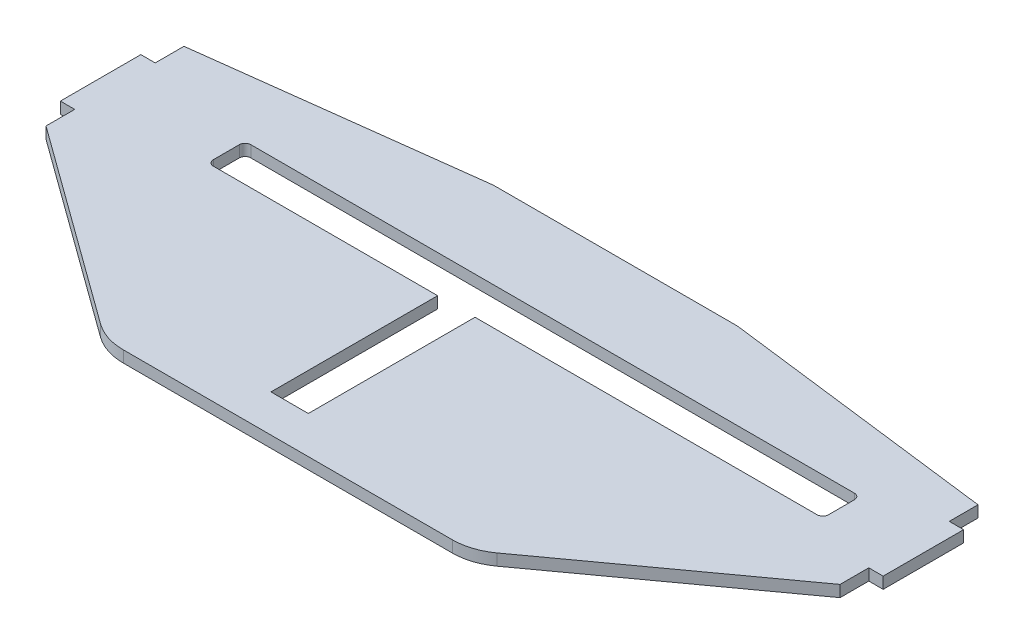
ISO-10303-21;
HEADER;
FILE_DESCRIPTION(('STEP AP214'),'2;1');
FILE_NAME('part.step','',(''),(''),'','','');
FILE_SCHEMA(('AUTOMOTIVE_DESIGN { 1 0 10303 214 1 1 1 1 }'));
ENDSEC;
DATA;
#1=APPLICATION_CONTEXT('core data for automotive mechanical design processes');
#2=APPLICATION_PROTOCOL_DEFINITION('international standard','automotive_design',2000,#1);
#3=PRODUCT_CONTEXT('',#1,'mechanical');
#4=PRODUCT('Part','Part','',(#3));
#5=PRODUCT_RELATED_PRODUCT_CATEGORY('part','',(#4));
#6=PRODUCT_DEFINITION_FORMATION('','',#4);
#7=PRODUCT_DEFINITION_CONTEXT('part definition',#1,'design');
#8=PRODUCT_DEFINITION('design','',#6,#7);
#9=PRODUCT_DEFINITION_SHAPE('','',#8);
#10=(LENGTH_UNIT() NAMED_UNIT(*) SI_UNIT(.MILLI.,.METRE.));
#11=(NAMED_UNIT(*) PLANE_ANGLE_UNIT() SI_UNIT($,.RADIAN.));
#12=(NAMED_UNIT(*) SI_UNIT($,.STERADIAN.) SOLID_ANGLE_UNIT());
#13=UNCERTAINTY_MEASURE_WITH_UNIT(LENGTH_MEASURE(1.E-05),#10,'distance_accuracy_value','');
#14=(GEOMETRIC_REPRESENTATION_CONTEXT(3) GLOBAL_UNCERTAINTY_ASSIGNED_CONTEXT((#13)) GLOBAL_UNIT_ASSIGNED_CONTEXT((#10,
#11,#12)) REPRESENTATION_CONTEXT('',''));
#15=CARTESIAN_POINT('',(0.,0.,0.));
#16=DIRECTION('',(0.,0.,1.));
#17=DIRECTION('',(1.,0.,0.));
#18=AXIS2_PLACEMENT_3D('',#15,#16,#17);
#19=CARTESIAN_POINT('',(-69.0671783012381,2.,-22.690493718196));
#20=DIRECTION('',(1.,0.,0.));
#21=DIRECTION('',(0.,0.,-1.));
#22=AXIS2_PLACEMENT_3D('',#19,#20,#21);
#23=PLANE('',#22);
#24=DIRECTION('',(0.,0.,1.));
#25=VECTOR('',#24,1.);
#26=CARTESIAN_POINT('',(-69.0671783012381,0.,-22.690493718196));
#27=LINE('',#26,#25);
#28=CARTESIAN_POINT('',(-69.0671783012381,0.,-27.690493718196));
#29=VERTEX_POINT('',#28);
#30=CARTESIAN_POINT('',(-69.0671783012381,0.,-22.690493718196));
#31=VERTEX_POINT('',#30);
#32=EDGE_CURVE('E416',#29,#31,#27,.T.);
#33=ORIENTED_EDGE('',*,*,#32,.T.);
#34=DIRECTION('',(0.,-1.,0.));
#35=VECTOR('',#34,1.);
#36=CARTESIAN_POINT('',(-69.0671783012381,2.,-22.690493718196));
#37=LINE('',#36,#35);
#38=CARTESIAN_POINT('',(-69.0671783012381,2.,-22.690493718196));
#39=VERTEX_POINT('',#38);
#40=EDGE_CURVE('E11',#39,#31,#37,.T.);
#41=ORIENTED_EDGE('',*,*,#40,.F.);
#42=DIRECTION('',(0.,0.,1.));
#43=VECTOR('',#42,1.);
#44=CARTESIAN_POINT('',(-69.0671783012381,2.,-22.690493718196));
#45=LINE('',#44,#43);
#46=CARTESIAN_POINT('',(-69.0671783012381,2.,-27.690493718196));
#47=VERTEX_POINT('',#46);
#48=EDGE_CURVE('E417',#47,#39,#45,.T.);
#49=ORIENTED_EDGE('',*,*,#48,.F.);
#50=DIRECTION('',(0.,-1.,0.));
#51=VECTOR('',#50,1.);
#52=CARTESIAN_POINT('',(-69.0671783012381,2.,-27.690493718196));
#53=LINE('',#52,#51);
#54=EDGE_CURVE('E441',#47,#29,#53,.T.);
#55=ORIENTED_EDGE('',*,*,#54,.T.);
#56=EDGE_LOOP('',(#33,#41,#49,#55));
#57=FACE_BOUND('',#56,.T.);
#58=ADVANCED_FACE('F32',(#57),#23,.F.);
#59=CARTESIAN_POINT('',(-71.5671783012381,2.,-22.690493718196));
#60=DIRECTION('',(0.,0.,1.));
#61=DIRECTION('',(1.,0.,0.));
#62=AXIS2_PLACEMENT_3D('',#59,#60,#61);
#63=PLANE('',#62);
#64=DIRECTION('',(-1.,0.,0.));
#65=VECTOR('',#64,1.);
#66=CARTESIAN_POINT('',(-71.5671783012381,0.,-22.690493718196));
#67=LINE('',#66,#65);
#68=CARTESIAN_POINT('',(-71.5671783012381,0.,-22.690493718196));
#69=VERTEX_POINT('',#68);
#70=EDGE_CURVE('E444',#31,#69,#67,.T.);
#71=ORIENTED_EDGE('',*,*,#70,.T.);
#72=DIRECTION('',(0.,-1.,0.));
#73=VECTOR('',#72,1.);
#74=CARTESIAN_POINT('',(-71.5671783012381,2.,-22.690493718196));
#75=LINE('',#74,#73);
#76=CARTESIAN_POINT('',(-71.5671783012381,2.,-22.690493718196));
#77=VERTEX_POINT('',#76);
#78=EDGE_CURVE('E39',#77,#69,#75,.T.);
#79=ORIENTED_EDGE('',*,*,#78,.F.);
#80=DIRECTION('',(-1.,0.,0.));
#81=VECTOR('',#80,1.);
#82=CARTESIAN_POINT('',(-71.5671783012381,2.,-22.690493718196));
#83=LINE('',#82,#81);
#84=EDGE_CURVE('E420',#39,#77,#83,.T.);
#85=ORIENTED_EDGE('',*,*,#84,.F.);
#86=ORIENTED_EDGE('',*,*,#40,.T.);
#87=EDGE_LOOP('',(#71,#79,#85,#86));
#88=FACE_BOUND('',#87,.T.);
#89=ADVANCED_FACE('F511',(#88),#63,.F.);
#90=CARTESIAN_POINT('',(-71.5671783012381,2.,-8.69049371819603));
#91=DIRECTION('',(1.,0.,0.));
#92=DIRECTION('',(0.,0.,-1.));
#93=AXIS2_PLACEMENT_3D('',#90,#91,#92);
#94=PLANE('',#93);
#95=DIRECTION('',(0.,0.,1.));
#96=VECTOR('',#95,1.);
#97=CARTESIAN_POINT('',(-71.5671783012381,0.,-8.69049371819603));
#98=LINE('',#97,#96);
#99=CARTESIAN_POINT('',(-71.5671783012381,0.,-8.69049371819603));
#100=VERTEX_POINT('',#99);
#101=EDGE_CURVE('E446',#69,#100,#98,.T.);
#102=ORIENTED_EDGE('',*,*,#101,.T.);
#103=DIRECTION('',(0.,-1.,0.));
#104=VECTOR('',#103,1.);
#105=CARTESIAN_POINT('',(-71.5671783012381,2.,-8.69049371819603));
#106=LINE('',#105,#104);
#107=CARTESIAN_POINT('',(-71.5671783012381,2.,-8.69049371819603));
#108=VERTEX_POINT('',#107);
#109=EDGE_CURVE('E483',#108,#100,#106,.T.);
#110=ORIENTED_EDGE('',*,*,#109,.F.);
#111=DIRECTION('',(0.,0.,1.));
#112=VECTOR('',#111,1.);
#113=CARTESIAN_POINT('',(-71.5671783012381,2.,-8.69049371819603));
#114=LINE('',#113,#112);
#115=EDGE_CURVE('E423',#77,#108,#114,.T.);
#116=ORIENTED_EDGE('',*,*,#115,.F.);
#117=ORIENTED_EDGE('',*,*,#78,.T.);
#118=EDGE_LOOP('',(#102,#110,#116,#117));
#119=FACE_BOUND('',#118,.T.);
#120=ADVANCED_FACE('F490',(#119),#94,.F.);
#121=CARTESIAN_POINT('',(-69.0671783012381,2.,-8.69049371819603));
#122=DIRECTION('',(0.,0.,-1.));
#123=DIRECTION('',(-1.,0.,0.));
#124=AXIS2_PLACEMENT_3D('',#121,#122,#123);
#125=PLANE('',#124);
#126=DIRECTION('',(1.,0.,0.));
#127=VECTOR('',#126,1.);
#128=CARTESIAN_POINT('',(-69.0671783012381,0.,-8.69049371819603));
#129=LINE('',#128,#127);
#130=CARTESIAN_POINT('',(-69.0671783012381,0.,-8.69049371819603));
#131=VERTEX_POINT('',#130);
#132=EDGE_CURVE('E448',#100,#131,#129,.T.);
#133=ORIENTED_EDGE('',*,*,#132,.T.);
#134=DIRECTION('',(0.,-1.,0.));
#135=VECTOR('',#134,1.);
#136=CARTESIAN_POINT('',(-69.0671783012381,2.,-8.69049371819603));
#137=LINE('',#136,#135);
#138=CARTESIAN_POINT('',(-69.0671783012381,2.,-8.69049371819603));
#139=VERTEX_POINT('',#138);
#140=EDGE_CURVE('E480',#139,#131,#137,.T.);
#141=ORIENTED_EDGE('',*,*,#140,.F.);
#142=DIRECTION('',(1.,0.,0.));
#143=VECTOR('',#142,1.);
#144=CARTESIAN_POINT('',(-69.0671783012381,2.,-8.69049371819603));
#145=LINE('',#144,#143);
#146=EDGE_CURVE('E425',#108,#139,#145,.T.);
#147=ORIENTED_EDGE('',*,*,#146,.F.);
#148=ORIENTED_EDGE('',*,*,#109,.T.);
#149=EDGE_LOOP('',(#133,#141,#147,#148));
#150=FACE_BOUND('',#149,.T.);
#151=ADVANCED_FACE('F499',(#150),#125,.F.);
#152=CARTESIAN_POINT('',(-69.0671783012381,2.,-3.69049371819603));
#153=DIRECTION('',(1.,0.,0.));
#154=DIRECTION('',(0.,0.,-1.));
#155=AXIS2_PLACEMENT_3D('',#152,#153,#154);
#156=PLANE('',#155);
#157=DIRECTION('',(0.,0.,1.));
#158=VECTOR('',#157,1.);
#159=CARTESIAN_POINT('',(-69.0671783012381,0.,-3.69049371819603));
#160=LINE('',#159,#158);
#161=CARTESIAN_POINT('',(-69.0671783012381,0.,-3.69049371819603));
#162=VERTEX_POINT('',#161);
#163=EDGE_CURVE('E450',#131,#162,#160,.T.);
#164=ORIENTED_EDGE('',*,*,#163,.T.);
#165=DIRECTION('',(0.,-1.,0.));
#166=VECTOR('',#165,1.);
#167=CARTESIAN_POINT('',(-69.0671783012381,2.,-3.69049371819603));
#168=LINE('',#167,#166);
#169=CARTESIAN_POINT('',(-69.0671783012381,2.,-3.69049371819603));
#170=VERTEX_POINT('',#169);
#171=EDGE_CURVE('E477',#170,#162,#168,.T.);
#172=ORIENTED_EDGE('',*,*,#171,.F.);
#173=DIRECTION('',(0.,0.,1.));
#174=VECTOR('',#173,1.);
#175=CARTESIAN_POINT('',(-69.0671783012381,2.,-3.69049371819603));
#176=LINE('',#175,#174);
#177=EDGE_CURVE('E427',#139,#170,#176,.T.);
#178=ORIENTED_EDGE('',*,*,#177,.F.);
#179=ORIENTED_EDGE('',*,*,#140,.T.);
#180=EDGE_LOOP('',(#164,#172,#178,#179));
#181=FACE_BOUND('',#180,.T.);
#182=ADVANCED_FACE('F503',(#181),#156,.F.);
#183=CARTESIAN_POINT('',(-34.4810790475041,2.,21.4034902651961));
#184=DIRECTION('',(0.587259936285379,0.,-0.809398398339219));
#185=DIRECTION('',(-0.809398398339219,0.,-0.587259936285379));
#186=AXIS2_PLACEMENT_3D('',#183,#184,#185);
#187=PLANE('',#186);
#188=DIRECTION('',(0.809398398339219,0.,0.587259936285379));
#189=VECTOR('',#188,1.);
#190=CARTESIAN_POINT('',(-34.4810790475041,0.,21.4034902651961));
#191=LINE('',#190,#189);
#192=CARTESIAN_POINT('',(-34.4810790475041,0.,21.4034902651961));
#193=VERTEX_POINT('',#192);
#194=EDGE_CURVE('E452',#162,#193,#191,.T.);
#195=ORIENTED_EDGE('',*,*,#194,.T.);
#196=DIRECTION('',(0.,-1.,0.));
#197=VECTOR('',#196,1.);
#198=CARTESIAN_POINT('',(-34.4810790475041,2.,21.4034902651961));
#199=LINE('',#198,#197);
#200=CARTESIAN_POINT('',(-34.4810790475041,2.,21.4034902651961));
#201=VERTEX_POINT('',#200);
#202=EDGE_CURVE('E474',#201,#193,#199,.T.);
#203=ORIENTED_EDGE('',*,*,#202,.F.);
#204=DIRECTION('',(0.809398398339219,0.,0.587259936285379));
#205=VECTOR('',#204,1.);
#206=CARTESIAN_POINT('',(-34.4810790475041,2.,21.4034902651961));
#207=LINE('',#206,#205);
#208=EDGE_CURVE('E429',#170,#201,#207,.T.);
#209=ORIENTED_EDGE('',*,*,#208,.F.);
#210=ORIENTED_EDGE('',*,*,#171,.T.);
#211=EDGE_LOOP('',(#195,#203,#209,#210));
#212=FACE_BOUND('',#211,.T.);
#213=ADVANCED_FACE('F574',(#212),#187,.F.);
#214=CARTESIAN_POINT('',(-28.6084796846503,2.,13.309506281804));
#215=DIRECTION('',(0.,-1.,0.));
#216=DIRECTION('',(0.,0.,-1.));
#217=AXIS2_PLACEMENT_3D('',#214,#215,#216);
#218=CYLINDRICAL_SURFACE('',#217,10.);
#219=CARTESIAN_POINT('',(-28.6084796846503,0.,13.309506281804));
#220=DIRECTION('',(0.,1.,0.));
#221=DIRECTION('',(0.,0.,-1.));
#222=AXIS2_PLACEMENT_3D('',#219,#220,#221);
#223=CIRCLE('',#222,10.);
#224=CARTESIAN_POINT('',(-28.6084796846502,0.,23.309506281804));
#225=VERTEX_POINT('',#224);
#226=EDGE_CURVE('E454',#193,#225,#223,.T.);
#227=ORIENTED_EDGE('',*,*,#226,.T.);
#228=DIRECTION('',(0.,-1.,0.));
#229=VECTOR('',#228,1.);
#230=CARTESIAN_POINT('',(-28.6084796846502,2.,23.309506281804));
#231=LINE('',#230,#229);
#232=CARTESIAN_POINT('',(-28.6084796846502,2.,23.309506281804));
#233=VERTEX_POINT('',#232);
#234=EDGE_CURVE('E471',#233,#225,#231,.T.);
#235=ORIENTED_EDGE('',*,*,#234,.F.);
#236=CARTESIAN_POINT('',(-28.6084796846503,2.,13.309506281804));
#237=DIRECTION('',(0.,1.,0.));
#238=DIRECTION('',(0.,0.,-1.));
#239=AXIS2_PLACEMENT_3D('',#236,#237,#238);
#240=CIRCLE('',#239,10.);
#241=EDGE_CURVE('E431',#201,#233,#240,.T.);
#242=ORIENTED_EDGE('',*,*,#241,.F.);
#243=ORIENTED_EDGE('',*,*,#202,.T.);
#244=EDGE_LOOP('',(#227,#235,#242,#243));
#245=FACE_BOUND('',#244,.T.);
#246=ADVANCED_FACE('F572',(#245),#218,.T.);
#247=CARTESIAN_POINT('',(0.,2.,23.309506281804));
#248=DIRECTION('',(0.,0.,-1.));
#249=DIRECTION('',(-1.,0.,0.));
#250=AXIS2_PLACEMENT_3D('',#247,#248,#249);
#251=PLANE('',#250);
#252=DIRECTION('',(1.,0.,0.));
#253=VECTOR('',#252,1.);
#254=CARTESIAN_POINT('',(0.,0.,23.309506281804));
#255=LINE('',#254,#253);
#256=CARTESIAN_POINT('',(28.6084796846502,0.,23.309506281804));
#257=VERTEX_POINT('',#256);
#258=EDGE_CURVE('E456',#225,#257,#255,.T.);
#259=ORIENTED_EDGE('',*,*,#258,.T.);
#260=DIRECTION('',(0.,-1.,0.));
#261=VECTOR('',#260,1.);
#262=CARTESIAN_POINT('',(28.6084796846502,2.,23.309506281804));
#263=LINE('',#262,#261);
#264=CARTESIAN_POINT('',(28.6084796846502,2.,23.309506281804));
#265=VERTEX_POINT('',#264);
#266=EDGE_CURVE('E406',#265,#257,#263,.T.);
#267=ORIENTED_EDGE('',*,*,#266,.F.);
#268=DIRECTION('',(1.,0.,0.));
#269=VECTOR('',#268,1.);
#270=CARTESIAN_POINT('',(0.,2.,23.309506281804));
#271=LINE('',#270,#269);
#272=EDGE_CURVE('E433',#233,#265,#271,.T.);
#273=ORIENTED_EDGE('',*,*,#272,.F.);
#274=ORIENTED_EDGE('',*,*,#234,.T.);
#275=EDGE_LOOP('',(#259,#267,#273,#274));
#276=FACE_BOUND('',#275,.T.);
#277=ADVANCED_FACE('F568',(#276),#251,.F.);
#278=CARTESIAN_POINT('',(-20.5975040431738,2.,-33.690493718196));
#279=DIRECTION('',(0.,0.,1.));
#280=DIRECTION('',(1.,0.,0.));
#281=AXIS2_PLACEMENT_3D('',#278,#279,#280);
#282=PLANE('',#281);
#283=DIRECTION('',(-1.,0.,0.));
#284=VECTOR('',#283,1.);
#285=CARTESIAN_POINT('',(-20.5975040431738,0.,-33.690493718196));
#286=LINE('',#285,#284);
#287=CARTESIAN_POINT('',(20.5975040431738,0.,-33.690493718196));
#288=VERTEX_POINT('',#287);
#289=CARTESIAN_POINT('',(-20.5975040431738,0.,-33.690493718196));
#290=VERTEX_POINT('',#289);
#291=EDGE_CURVE('E458',#288,#290,#286,.T.);
#292=ORIENTED_EDGE('',*,*,#291,.T.);
#293=DIRECTION('',(0.,-1.,0.));
#294=VECTOR('',#293,1.);
#295=CARTESIAN_POINT('',(-20.5975040431738,2.,-33.690493718196));
#296=LINE('',#295,#294);
#297=CARTESIAN_POINT('',(-20.5975040431738,2.,-33.690493718196));
#298=VERTEX_POINT('',#297);
#299=EDGE_CURVE('E468',#298,#290,#296,.T.);
#300=ORIENTED_EDGE('',*,*,#299,.F.);
#301=DIRECTION('',(-1.,0.,0.));
#302=VECTOR('',#301,1.);
#303=CARTESIAN_POINT('',(-20.5975040431738,2.,-33.690493718196));
#304=LINE('',#303,#302);
#305=CARTESIAN_POINT('',(20.5975040431738,2.,-33.690493718196));
#306=VERTEX_POINT('',#305);
#307=EDGE_CURVE('E435',#306,#298,#304,.T.);
#308=ORIENTED_EDGE('',*,*,#307,.F.);
#309=DIRECTION('',(0.,-1.,0.));
#310=VECTOR('',#309,1.);
#311=CARTESIAN_POINT('',(20.5975040431738,2.,-33.690493718196));
#312=LINE('',#311,#310);
#313=EDGE_CURVE('E409',#306,#288,#312,.T.);
#314=ORIENTED_EDGE('',*,*,#313,.T.);
#315=EDGE_LOOP('',(#292,#300,#308,#314));
#316=FACE_BOUND('',#315,.T.);
#317=ADVANCED_FACE('F525',(#316),#282,.F.);
#318=CARTESIAN_POINT('',(-20.5975040431739,2.,-23.690493718196));
#319=DIRECTION('',(0.,-1.,0.));
#320=DIRECTION('',(0.,0.,-1.));
#321=AXIS2_PLACEMENT_3D('',#318,#319,#320);
#322=CYLINDRICAL_SURFACE('',#321,10.);
#323=CARTESIAN_POINT('',(-20.5975040431739,0.,-23.690493718196));
#324=DIRECTION('',(0.,1.,0.));
#325=DIRECTION('',(0.,0.,1.));
#326=AXIS2_PLACEMENT_3D('',#323,#324,#325);
#327=CIRCLE('',#326,10.);
#328=CARTESIAN_POINT('',(-21.84180506005,0.,-33.6127774764546));
#329=VERTEX_POINT('',#328);
#330=EDGE_CURVE('E460',#290,#329,#327,.T.);
#331=ORIENTED_EDGE('',*,*,#330,.T.);
#332=DIRECTION('',(0.,-1.,0.));
#333=VECTOR('',#332,1.);
#334=CARTESIAN_POINT('',(-21.84180506005,2.,-33.6127774764546));
#335=LINE('',#334,#333);
#336=CARTESIAN_POINT('',(-21.84180506005,2.,-33.6127774764546));
#337=VERTEX_POINT('',#336);
#338=EDGE_CURVE('E465',#337,#329,#335,.T.);
#339=ORIENTED_EDGE('',*,*,#338,.F.);
#340=CARTESIAN_POINT('',(-20.5975040431739,2.,-23.690493718196));
#341=DIRECTION('',(0.,1.,0.));
#342=DIRECTION('',(0.,0.,1.));
#343=AXIS2_PLACEMENT_3D('',#340,#341,#342);
#344=CIRCLE('',#343,10.);
#345=EDGE_CURVE('E437',#298,#337,#344,.T.);
#346=ORIENTED_EDGE('',*,*,#345,.F.);
#347=ORIENTED_EDGE('',*,*,#299,.T.);
#348=EDGE_LOOP('',(#331,#339,#346,#347));
#349=FACE_BOUND('',#348,.T.);
#350=ADVANCED_FACE('F522',(#349),#322,.T.);
#351=CARTESIAN_POINT('',(-69.0671783012381,2.,-27.690493718196));
#352=DIRECTION('',(0.124430101687616,0.,0.992228375825853));
#353=DIRECTION('',(0.992228375825853,0.,-0.124430101687616));
#354=AXIS2_PLACEMENT_3D('',#351,#352,#353);
#355=PLANE('',#354);
#356=DIRECTION('',(-0.992228375825853,0.,0.124430101687616));
#357=VECTOR('',#356,1.);
#358=CARTESIAN_POINT('',(-69.0671783012381,0.,-27.690493718196));
#359=LINE('',#358,#357);
#360=EDGE_CURVE('E421',#329,#29,#359,.T.);
#361=ORIENTED_EDGE('',*,*,#360,.T.);
#362=ORIENTED_EDGE('',*,*,#54,.F.);
#363=DIRECTION('',(-0.992228375825853,0.,0.124430101687616));
#364=VECTOR('',#363,1.);
#365=CARTESIAN_POINT('',(-69.0671783012381,2.,-27.690493718196));
#366=LINE('',#365,#364);
#367=EDGE_CURVE('E439',#337,#47,#366,.T.);
#368=ORIENTED_EDGE('',*,*,#367,.F.);
#369=ORIENTED_EDGE('',*,*,#338,.T.);
#370=EDGE_LOOP('',(#361,#362,#368,#369));
#371=FACE_BOUND('',#370,.T.);
#372=ADVANCED_FACE('F517',(#371),#355,.F.);
#373=CARTESIAN_POINT('',(-20.5975040431739,2.,-23.690493718196));
#374=DIRECTION('',(0.,1.,0.));
#375=DIRECTION('',(0.,0.,1.));
#376=AXIS2_PLACEMENT_3D('',#373,#374,#375);
#377=PLANE('',#376);
#378=CARTESIAN_POINT('',(56.5671783012381,2.,-13.190493718196));
#379=DIRECTION('',(0.,1.,0.));
#380=DIRECTION('',(0.,0.,-1.));
#381=AXIS2_PLACEMENT_3D('',#378,#379,#380);
#382=CIRCLE('',#381,1.);
#383=CARTESIAN_POINT('',(56.5671783012381,2.,-12.190493718196));
#384=VERTEX_POINT('',#383);
#385=CARTESIAN_POINT('',(57.5671783012381,2.,-13.190493718196));
#386=VERTEX_POINT('',#385);
#387=EDGE_CURVE('E46',#384,#386,#382,.T.);
#388=ORIENTED_EDGE('',*,*,#387,.F.);
#389=DIRECTION('',(1.,0.,0.));
#390=VECTOR('',#389,1.);
#391=CARTESIAN_POINT('',(-2.93282169876188,2.,-12.190493718196));
#392=LINE('',#391,#390);
#393=CARTESIAN_POINT('',(-2.93282169876188,2.,-12.190493718196));
#394=VERTEX_POINT('',#393);
#395=EDGE_CURVE('E259',#394,#384,#392,.T.);
#396=ORIENTED_EDGE('',*,*,#395,.F.);
#397=DIRECTION('',(0.,0.,-1.));
#398=VECTOR('',#397,1.);
#399=CARTESIAN_POINT('',(-2.93282169876188,2.,16.809506281804));
#400=LINE('',#399,#398);
#401=CARTESIAN_POINT('',(-2.93282169876188,2.,16.809506281804));
#402=VERTEX_POINT('',#401);
#403=EDGE_CURVE('E262',#402,#394,#400,.T.);
#404=ORIENTED_EDGE('',*,*,#403,.F.);
#405=DIRECTION('',(1.,0.,0.));
#406=VECTOR('',#405,1.);
#407=CARTESIAN_POINT('',(-9.43282169876188,2.,16.809506281804));
#408=LINE('',#407,#406);
#409=CARTESIAN_POINT('',(-9.43282169876188,2.,16.809506281804));
#410=VERTEX_POINT('',#409);
#411=EDGE_CURVE('E314',#410,#402,#408,.T.);
#412=ORIENTED_EDGE('',*,*,#411,.F.);
#413=DIRECTION('',(0.,0.,1.));
#414=VECTOR('',#413,1.);
#415=CARTESIAN_POINT('',(-9.43282169876188,2.,16.809506281804));
#416=LINE('',#415,#414);
#417=CARTESIAN_POINT('',(-9.43282169876188,2.,-12.190493718196));
#418=VERTEX_POINT('',#417);
#419=EDGE_CURVE('E311',#418,#410,#416,.T.);
#420=ORIENTED_EDGE('',*,*,#419,.F.);
#421=DIRECTION('',(1.,0.,0.));
#422=VECTOR('',#421,1.);
#423=CARTESIAN_POINT('',(-48.4328216987619,2.,-12.190493718196));
#424=LINE('',#423,#422);
#425=CARTESIAN_POINT('',(-48.4328216987619,2.,-12.190493718196));
#426=VERTEX_POINT('',#425);
#427=EDGE_CURVE('E308',#426,#418,#424,.T.);
#428=ORIENTED_EDGE('',*,*,#427,.F.);
#429=CARTESIAN_POINT('',(-48.4328216987619,2.,-13.190493718196));
#430=DIRECTION('',(0.,1.,0.));
#431=DIRECTION('',(0.,0.,1.));
#432=AXIS2_PLACEMENT_3D('',#429,#430,#431);
#433=CIRCLE('',#432,1.);
#434=CARTESIAN_POINT('',(-49.4328216987619,2.,-13.190493718196));
#435=VERTEX_POINT('',#434);
#436=EDGE_CURVE('E305',#435,#426,#433,.T.);
#437=ORIENTED_EDGE('',*,*,#436,.F.);
#438=DIRECTION('',(0.,0.,1.));
#439=VECTOR('',#438,1.);
#440=CARTESIAN_POINT('',(-49.4328216987619,2.,-17.690493718196));
#441=LINE('',#440,#439);
#442=CARTESIAN_POINT('',(-49.4328216987619,2.,-17.690493718196));
#443=VERTEX_POINT('',#442);
#444=EDGE_CURVE('E302',#443,#435,#441,.T.);
#445=ORIENTED_EDGE('',*,*,#444,.F.);
#446=CARTESIAN_POINT('',(-48.4328216987619,2.,-17.690493718196));
#447=DIRECTION('',(0.,1.,0.));
#448=DIRECTION('',(0.,0.,-1.));
#449=AXIS2_PLACEMENT_3D('',#446,#447,#448);
#450=CIRCLE('',#449,1.);
#451=CARTESIAN_POINT('',(-48.4328216987619,2.,-18.690493718196));
#452=VERTEX_POINT('',#451);
#453=EDGE_CURVE('E299',#452,#443,#450,.T.);
#454=ORIENTED_EDGE('',*,*,#453,.F.);
#455=DIRECTION('',(-1.,0.,0.));
#456=VECTOR('',#455,1.);
#457=CARTESIAN_POINT('',(-48.4328216987619,2.,-18.690493718196));
#458=LINE('',#457,#456);
#459=CARTESIAN_POINT('',(56.5671783012381,2.,-18.690493718196));
#460=VERTEX_POINT('',#459);
#461=EDGE_CURVE('E296',#460,#452,#458,.T.);
#462=ORIENTED_EDGE('',*,*,#461,.F.);
#463=CARTESIAN_POINT('',(56.5671783012381,2.,-17.690493718196));
#464=DIRECTION('',(0.,1.,0.));
#465=DIRECTION('',(0.,0.,1.));
#466=AXIS2_PLACEMENT_3D('',#463,#464,#465);
#467=CIRCLE('',#466,1.);
#468=CARTESIAN_POINT('',(57.5671783012381,2.,-17.690493718196));
#469=VERTEX_POINT('',#468);
#470=EDGE_CURVE('E293',#469,#460,#467,.T.);
#471=ORIENTED_EDGE('',*,*,#470,.F.);
#472=DIRECTION('',(0.,0.,-1.));
#473=VECTOR('',#472,1.);
#474=CARTESIAN_POINT('',(57.5671783012381,2.,-17.690493718196));
#475=LINE('',#474,#473);
#476=EDGE_CURVE('E291',#386,#469,#475,.T.);
#477=ORIENTED_EDGE('',*,*,#476,.F.);
#478=EDGE_LOOP('',(#388,#396,#404,#412,#420,#428,#437,#445,#454,#462,#471,#477));
#479=FACE_BOUND('',#478,.T.);
#480=ORIENTED_EDGE('',*,*,#48,.T.);
#481=ORIENTED_EDGE('',*,*,#84,.T.);
#482=ORIENTED_EDGE('',*,*,#115,.T.);
#483=ORIENTED_EDGE('',*,*,#146,.T.);
#484=ORIENTED_EDGE('',*,*,#177,.T.);
#485=ORIENTED_EDGE('',*,*,#208,.T.);
#486=ORIENTED_EDGE('',*,*,#241,.T.);
#487=ORIENTED_EDGE('',*,*,#272,.T.);
#488=CARTESIAN_POINT('',(28.6084796846503,2.,13.309506281804));
#489=DIRECTION('',(0.,-1.,0.));
#490=DIRECTION('',(0.,0.,-1.));
#491=AXIS2_PLACEMENT_3D('',#488,#489,#490);
#492=CIRCLE('',#491,10.);
#493=CARTESIAN_POINT('',(34.4810790475041,2.,21.4034902651961));
#494=VERTEX_POINT('',#493);
#495=EDGE_CURVE('E351',#494,#265,#492,.T.);
#496=ORIENTED_EDGE('',*,*,#495,.F.);
#497=DIRECTION('',(-0.809398398339219,0.,0.587259936285379));
#498=VECTOR('',#497,1.);
#499=CARTESIAN_POINT('',(34.4810790475041,2.,21.4034902651961));
#500=LINE('',#499,#498);
#501=CARTESIAN_POINT('',(69.0671783012381,2.,-3.69049371819604));
#502=VERTEX_POINT('',#501);
#503=EDGE_CURVE('E354',#502,#494,#500,.T.);
#504=ORIENTED_EDGE('',*,*,#503,.F.);
#505=DIRECTION('',(0.,0.,1.));
#506=VECTOR('',#505,1.);
#507=CARTESIAN_POINT('',(69.0671783012381,2.,-3.69049371819604));
#508=LINE('',#507,#506);
#509=CARTESIAN_POINT('',(69.0671783012381,2.,-8.69049371819604));
#510=VERTEX_POINT('',#509);
#511=EDGE_CURVE('E357',#510,#502,#508,.T.);
#512=ORIENTED_EDGE('',*,*,#511,.F.);
#513=DIRECTION('',(-1.,0.,0.));
#514=VECTOR('',#513,1.);
#515=CARTESIAN_POINT('',(69.0671783012381,2.,-8.69049371819604));
#516=LINE('',#515,#514);
#517=CARTESIAN_POINT('',(71.5671783012381,2.,-8.69049371819604));
#518=VERTEX_POINT('',#517);
#519=EDGE_CURVE('E360',#518,#510,#516,.T.);
#520=ORIENTED_EDGE('',*,*,#519,.F.);
#521=DIRECTION('',(0.,0.,1.));
#522=VECTOR('',#521,1.);
#523=CARTESIAN_POINT('',(71.5671783012381,2.,-8.69049371819604));
#524=LINE('',#523,#522);
#525=CARTESIAN_POINT('',(71.5671783012381,2.,-22.690493718196));
#526=VERTEX_POINT('',#525);
#527=EDGE_CURVE('E363',#526,#518,#524,.T.);
#528=ORIENTED_EDGE('',*,*,#527,.F.);
#529=DIRECTION('',(1.,0.,0.));
#530=VECTOR('',#529,1.);
#531=CARTESIAN_POINT('',(71.5671783012381,2.,-22.690493718196));
#532=LINE('',#531,#530);
#533=CARTESIAN_POINT('',(69.0671783012381,2.,-22.690493718196));
#534=VERTEX_POINT('',#533);
#535=EDGE_CURVE('E366',#534,#526,#532,.T.);
#536=ORIENTED_EDGE('',*,*,#535,.F.);
#537=DIRECTION('',(0.,0.,1.));
#538=VECTOR('',#537,1.);
#539=CARTESIAN_POINT('',(69.0671783012381,2.,-22.690493718196));
#540=LINE('',#539,#538);
#541=CARTESIAN_POINT('',(69.0671783012381,2.,-27.690493718196));
#542=VERTEX_POINT('',#541);
#543=EDGE_CURVE('E341',#542,#534,#540,.T.);
#544=ORIENTED_EDGE('',*,*,#543,.F.);
#545=DIRECTION('',(0.992228375825853,0.,0.124430101687616));
#546=VECTOR('',#545,1.);
#547=CARTESIAN_POINT('',(69.0671783012381,2.,-27.690493718196));
#548=LINE('',#547,#546);
#549=CARTESIAN_POINT('',(21.84180506005,2.,-33.6127774764546));
#550=VERTEX_POINT('',#549);
#551=EDGE_CURVE('E344',#550,#542,#548,.T.);
#552=ORIENTED_EDGE('',*,*,#551,.F.);
#553=CARTESIAN_POINT('',(20.5975040431739,2.,-23.690493718196));
#554=DIRECTION('',(0.,-1.,0.));
#555=DIRECTION('',(0.,0.,1.));
#556=AXIS2_PLACEMENT_3D('',#553,#554,#555);
#557=CIRCLE('',#556,10.);
#558=EDGE_CURVE('E348',#306,#550,#557,.T.);
#559=ORIENTED_EDGE('',*,*,#558,.F.);
#560=ORIENTED_EDGE('',*,*,#307,.T.);
#561=ORIENTED_EDGE('',*,*,#345,.T.);
#562=ORIENTED_EDGE('',*,*,#367,.T.);
#563=EDGE_LOOP('',(#480,#481,#482,#483,#484,#485,#486,#487,#496,#504,#512,#520,#528,#536,#544,
#552,#559,#560,#561,#562));
#564=FACE_BOUND('',#563,.T.);
#565=ADVANCED_FACE('F507',(#479,#564),#377,.T.);
#566=CARTESIAN_POINT('',(-20.5975040431739,0.,-23.690493718196));
#567=DIRECTION('',(0.,1.,0.));
#568=DIRECTION('',(0.,0.,1.));
#569=AXIS2_PLACEMENT_3D('',#566,#567,#568);
#570=PLANE('',#569);
#571=DIRECTION('',(1.,0.,0.));
#572=VECTOR('',#571,1.);
#573=CARTESIAN_POINT('',(-2.93282169876188,0.,-12.190493718196));
#574=LINE('',#573,#572);
#575=CARTESIAN_POINT('',(-2.93282169876188,0.,-12.190493718196));
#576=VERTEX_POINT('',#575);
#577=CARTESIAN_POINT('',(56.5671783012381,0.,-12.190493718196));
#578=VERTEX_POINT('',#577);
#579=EDGE_CURVE('E248',#576,#578,#574,.T.);
#580=ORIENTED_EDGE('',*,*,#579,.T.);
#581=CARTESIAN_POINT('',(56.5671783012381,0.,-13.190493718196));
#582=DIRECTION('',(0.,1.,0.));
#583=DIRECTION('',(0.,0.,-1.));
#584=AXIS2_PLACEMENT_3D('',#581,#582,#583);
#585=CIRCLE('',#584,1.);
#586=CARTESIAN_POINT('',(57.5671783012381,0.,-13.190493718196));
#587=VERTEX_POINT('',#586);
#588=EDGE_CURVE('E242',#578,#587,#585,.T.);
#589=ORIENTED_EDGE('',*,*,#588,.T.);
#590=DIRECTION('',(0.,0.,-1.));
#591=VECTOR('',#590,1.);
#592=CARTESIAN_POINT('',(57.5671783012381,0.,-17.690493718196));
#593=LINE('',#592,#591);
#594=CARTESIAN_POINT('',(57.5671783012381,0.,-17.690493718196));
#595=VERTEX_POINT('',#594);
#596=EDGE_CURVE('E251',#587,#595,#593,.T.);
#597=ORIENTED_EDGE('',*,*,#596,.T.);
#598=CARTESIAN_POINT('',(56.5671783012381,0.,-17.690493718196));
#599=DIRECTION('',(0.,1.,0.));
#600=DIRECTION('',(0.,0.,1.));
#601=AXIS2_PLACEMENT_3D('',#598,#599,#600);
#602=CIRCLE('',#601,1.);
#603=CARTESIAN_POINT('',(56.5671783012381,0.,-18.690493718196));
#604=VERTEX_POINT('',#603);
#605=EDGE_CURVE('E54',#595,#604,#602,.T.);
#606=ORIENTED_EDGE('',*,*,#605,.T.);
#607=DIRECTION('',(-1.,0.,0.));
#608=VECTOR('',#607,1.);
#609=CARTESIAN_POINT('',(-48.4328216987619,0.,-18.690493718196));
#610=LINE('',#609,#608);
#611=CARTESIAN_POINT('',(-48.4328216987619,0.,-18.690493718196));
#612=VERTEX_POINT('',#611);
#613=EDGE_CURVE('E266',#604,#612,#610,.T.);
#614=ORIENTED_EDGE('',*,*,#613,.T.);
#615=CARTESIAN_POINT('',(-48.4328216987619,0.,-17.690493718196));
#616=DIRECTION('',(0.,1.,0.));
#617=DIRECTION('',(0.,0.,-1.));
#618=AXIS2_PLACEMENT_3D('',#615,#616,#617);
#619=CIRCLE('',#618,1.);
#620=CARTESIAN_POINT('',(-49.4328216987619,0.,-17.690493718196));
#621=VERTEX_POINT('',#620);
#622=EDGE_CURVE('E269',#612,#621,#619,.T.);
#623=ORIENTED_EDGE('',*,*,#622,.T.);
#624=DIRECTION('',(0.,0.,1.));
#625=VECTOR('',#624,1.);
#626=CARTESIAN_POINT('',(-49.4328216987619,0.,-17.690493718196));
#627=LINE('',#626,#625);
#628=CARTESIAN_POINT('',(-49.4328216987619,0.,-13.190493718196));
#629=VERTEX_POINT('',#628);
#630=EDGE_CURVE('E272',#621,#629,#627,.T.);
#631=ORIENTED_EDGE('',*,*,#630,.T.);
#632=CARTESIAN_POINT('',(-48.4328216987619,0.,-13.190493718196));
#633=DIRECTION('',(0.,1.,0.));
#634=DIRECTION('',(0.,0.,1.));
#635=AXIS2_PLACEMENT_3D('',#632,#633,#634);
#636=CIRCLE('',#635,1.);
#637=CARTESIAN_POINT('',(-48.4328216987619,0.,-12.190493718196));
#638=VERTEX_POINT('',#637);
#639=EDGE_CURVE('E275',#629,#638,#636,.T.);
#640=ORIENTED_EDGE('',*,*,#639,.T.);
#641=DIRECTION('',(1.,0.,0.));
#642=VECTOR('',#641,1.);
#643=CARTESIAN_POINT('',(-48.4328216987619,0.,-12.190493718196));
#644=LINE('',#643,#642);
#645=CARTESIAN_POINT('',(-9.43282169876188,0.,-12.190493718196));
#646=VERTEX_POINT('',#645);
#647=EDGE_CURVE('E278',#638,#646,#644,.T.);
#648=ORIENTED_EDGE('',*,*,#647,.T.);
#649=DIRECTION('',(0.,0.,1.));
#650=VECTOR('',#649,1.);
#651=CARTESIAN_POINT('',(-9.43282169876188,0.,16.809506281804));
#652=LINE('',#651,#650);
#653=CARTESIAN_POINT('',(-9.43282169876188,0.,16.809506281804));
#654=VERTEX_POINT('',#653);
#655=EDGE_CURVE('E281',#646,#654,#652,.T.);
#656=ORIENTED_EDGE('',*,*,#655,.T.);
#657=DIRECTION('',(1.,0.,0.));
#658=VECTOR('',#657,1.);
#659=CARTESIAN_POINT('',(-9.43282169876188,0.,16.809506281804));
#660=LINE('',#659,#658);
#661=CARTESIAN_POINT('',(-2.93282169876188,0.,16.809506281804));
#662=VERTEX_POINT('',#661);
#663=EDGE_CURVE('E284',#654,#662,#660,.T.);
#664=ORIENTED_EDGE('',*,*,#663,.T.);
#665=DIRECTION('',(0.,0.,-1.));
#666=VECTOR('',#665,1.);
#667=CARTESIAN_POINT('',(-2.93282169876188,0.,16.809506281804));
#668=LINE('',#667,#666);
#669=EDGE_CURVE('E287',#662,#576,#668,.T.);
#670=ORIENTED_EDGE('',*,*,#669,.T.);
#671=EDGE_LOOP('',(#580,#589,#597,#606,#614,#623,#631,#640,#648,#656,#664,#670));
#672=FACE_BOUND('',#671,.T.);
#673=ORIENTED_EDGE('',*,*,#32,.F.);
#674=ORIENTED_EDGE('',*,*,#360,.F.);
#675=ORIENTED_EDGE('',*,*,#330,.F.);
#676=ORIENTED_EDGE('',*,*,#291,.F.);
#677=CARTESIAN_POINT('',(20.5975040431739,0.,-23.690493718196));
#678=DIRECTION('',(0.,-1.,0.));
#679=DIRECTION('',(0.,0.,1.));
#680=AXIS2_PLACEMENT_3D('',#677,#678,#679);
#681=CIRCLE('',#680,10.);
#682=CARTESIAN_POINT('',(21.84180506005,0.,-33.6127774764546));
#683=VERTEX_POINT('',#682);
#684=EDGE_CURVE('E375',#288,#683,#681,.T.);
#685=ORIENTED_EDGE('',*,*,#684,.T.);
#686=DIRECTION('',(0.992228375825853,0.,0.124430101687616));
#687=VECTOR('',#686,1.);
#688=CARTESIAN_POINT('',(69.0671783012381,0.,-27.690493718196));
#689=LINE('',#688,#687);
#690=CARTESIAN_POINT('',(69.0671783012381,0.,-27.690493718196));
#691=VERTEX_POINT('',#690);
#692=EDGE_CURVE('E372',#683,#691,#689,.T.);
#693=ORIENTED_EDGE('',*,*,#692,.T.);
#694=DIRECTION('',(0.,0.,1.));
#695=VECTOR('',#694,1.);
#696=CARTESIAN_POINT('',(69.0671783012381,0.,-22.690493718196));
#697=LINE('',#696,#695);
#698=CARTESIAN_POINT('',(69.0671783012381,0.,-22.690493718196));
#699=VERTEX_POINT('',#698);
#700=EDGE_CURVE('E321',#691,#699,#697,.T.);
#701=ORIENTED_EDGE('',*,*,#700,.T.);
#702=DIRECTION('',(1.,0.,0.));
#703=VECTOR('',#702,1.);
#704=CARTESIAN_POINT('',(71.5671783012381,0.,-22.690493718196));
#705=LINE('',#704,#703);
#706=CARTESIAN_POINT('',(71.5671783012381,0.,-22.690493718196));
#707=VERTEX_POINT('',#706);
#708=EDGE_CURVE('E345',#699,#707,#705,.T.);
#709=ORIENTED_EDGE('',*,*,#708,.T.);
#710=DIRECTION('',(0.,0.,1.));
#711=VECTOR('',#710,1.);
#712=CARTESIAN_POINT('',(71.5671783012381,0.,-8.69049371819604));
#713=LINE('',#712,#711);
#714=CARTESIAN_POINT('',(71.5671783012381,0.,-8.69049371819604));
#715=VERTEX_POINT('',#714);
#716=EDGE_CURVE('E390',#707,#715,#713,.T.);
#717=ORIENTED_EDGE('',*,*,#716,.T.);
#718=DIRECTION('',(-1.,0.,0.));
#719=VECTOR('',#718,1.);
#720=CARTESIAN_POINT('',(69.0671783012381,0.,-8.69049371819604));
#721=LINE('',#720,#719);
#722=CARTESIAN_POINT('',(69.0671783012381,0.,-8.69049371819604));
#723=VERTEX_POINT('',#722);
#724=EDGE_CURVE('E387',#715,#723,#721,.T.);
#725=ORIENTED_EDGE('',*,*,#724,.T.);
#726=DIRECTION('',(0.,0.,1.));
#727=VECTOR('',#726,1.);
#728=CARTESIAN_POINT('',(69.0671783012381,0.,-3.69049371819604));
#729=LINE('',#728,#727);
#730=CARTESIAN_POINT('',(69.0671783012381,0.,-3.69049371819604));
#731=VERTEX_POINT('',#730);
#732=EDGE_CURVE('E384',#723,#731,#729,.T.);
#733=ORIENTED_EDGE('',*,*,#732,.T.);
#734=DIRECTION('',(-0.809398398339219,0.,0.587259936285379));
#735=VECTOR('',#734,1.);
#736=CARTESIAN_POINT('',(34.4810790475041,0.,21.4034902651961));
#737=LINE('',#736,#735);
#738=CARTESIAN_POINT('',(34.4810790475041,0.,21.4034902651961));
#739=VERTEX_POINT('',#738);
#740=EDGE_CURVE('E381',#731,#739,#737,.T.);
#741=ORIENTED_EDGE('',*,*,#740,.T.);
#742=CARTESIAN_POINT('',(28.6084796846503,0.,13.309506281804));
#743=DIRECTION('',(0.,-1.,0.));
#744=DIRECTION('',(0.,0.,-1.));
#745=AXIS2_PLACEMENT_3D('',#742,#743,#744);
#746=CIRCLE('',#745,10.);
#747=EDGE_CURVE('E378',#739,#257,#746,.T.);
#748=ORIENTED_EDGE('',*,*,#747,.T.);
#749=ORIENTED_EDGE('',*,*,#258,.F.);
#750=ORIENTED_EDGE('',*,*,#226,.F.);
#751=ORIENTED_EDGE('',*,*,#194,.F.);
#752=ORIENTED_EDGE('',*,*,#163,.F.);
#753=ORIENTED_EDGE('',*,*,#132,.F.);
#754=ORIENTED_EDGE('',*,*,#101,.F.);
#755=ORIENTED_EDGE('',*,*,#70,.F.);
#756=EDGE_LOOP('',(#673,#674,#675,#676,#685,#693,#701,#709,#717,#725,#733,#741,#748,#749,#750,
#751,#752,#753,#754,#755));
#757=FACE_BOUND('',#756,.T.);
#758=ADVANCED_FACE('F255',(#672,#757),#570,.F.);
#759=CARTESIAN_POINT('',(69.0671783012381,2.,-22.690493718196));
#760=DIRECTION('',(1.,0.,0.));
#761=DIRECTION('',(0.,0.,-1.));
#762=AXIS2_PLACEMENT_3D('',#759,#760,#761);
#763=PLANE('',#762);
#764=ORIENTED_EDGE('',*,*,#700,.F.);
#765=DIRECTION('',(0.,-1.,0.));
#766=VECTOR('',#765,1.);
#767=CARTESIAN_POINT('',(69.0671783012381,2.,-27.690493718196));
#768=LINE('',#767,#766);
#769=EDGE_CURVE('E414',#542,#691,#768,.T.);
#770=ORIENTED_EDGE('',*,*,#769,.F.);
#771=ORIENTED_EDGE('',*,*,#543,.T.);
#772=DIRECTION('',(0.,-1.,0.));
#773=VECTOR('',#772,1.);
#774=CARTESIAN_POINT('',(69.0671783012381,2.,-22.690493718196));
#775=LINE('',#774,#773);
#776=EDGE_CURVE('E369',#534,#699,#775,.T.);
#777=ORIENTED_EDGE('',*,*,#776,.T.);
#778=EDGE_LOOP('',(#764,#770,#771,#777));
#779=FACE_BOUND('',#778,.T.);
#780=ADVANCED_FACE('F538',(#779),#763,.T.);
#781=CARTESIAN_POINT('',(69.0671783012381,2.,-27.690493718196));
#782=DIRECTION('',(0.124430101687616,0.,-0.992228375825853));
#783=DIRECTION('',(-0.992228375825853,0.,-0.124430101687616));
#784=AXIS2_PLACEMENT_3D('',#781,#782,#783);
#785=PLANE('',#784);
#786=ORIENTED_EDGE('',*,*,#692,.F.);
#787=DIRECTION('',(0.,-1.,0.));
#788=VECTOR('',#787,1.);
#789=CARTESIAN_POINT('',(21.84180506005,2.,-33.6127774764546));
#790=LINE('',#789,#788);
#791=EDGE_CURVE('E412',#550,#683,#790,.T.);
#792=ORIENTED_EDGE('',*,*,#791,.F.);
#793=ORIENTED_EDGE('',*,*,#551,.T.);
#794=ORIENTED_EDGE('',*,*,#769,.T.);
#795=EDGE_LOOP('',(#786,#792,#793,#794));
#796=FACE_BOUND('',#795,.T.);
#797=ADVANCED_FACE('F534',(#796),#785,.T.);
#798=CARTESIAN_POINT('',(20.5975040431739,2.,-23.690493718196));
#799=DIRECTION('',(0.,-1.,0.));
#800=DIRECTION('',(0.,0.,-1.));
#801=AXIS2_PLACEMENT_3D('',#798,#799,#800);
#802=CYLINDRICAL_SURFACE('',#801,10.);
#803=ORIENTED_EDGE('',*,*,#684,.F.);
#804=ORIENTED_EDGE('',*,*,#313,.F.);
#805=ORIENTED_EDGE('',*,*,#558,.T.);
#806=ORIENTED_EDGE('',*,*,#791,.T.);
#807=EDGE_LOOP('',(#803,#804,#805,#806));
#808=FACE_BOUND('',#807,.T.);
#809=ADVANCED_FACE('F530',(#808),#802,.T.);
#810=CARTESIAN_POINT('',(28.6084796846503,2.,13.309506281804));
#811=DIRECTION('',(0.,-1.,0.));
#812=DIRECTION('',(0.,0.,-1.));
#813=AXIS2_PLACEMENT_3D('',#810,#811,#812);
#814=CYLINDRICAL_SURFACE('',#813,10.);
#815=ORIENTED_EDGE('',*,*,#747,.F.);
#816=DIRECTION('',(0.,-1.,0.));
#817=VECTOR('',#816,1.);
#818=CARTESIAN_POINT('',(34.4810790475041,2.,21.4034902651961));
#819=LINE('',#818,#817);
#820=EDGE_CURVE('E404',#494,#739,#819,.T.);
#821=ORIENTED_EDGE('',*,*,#820,.F.);
#822=ORIENTED_EDGE('',*,*,#495,.T.);
#823=ORIENTED_EDGE('',*,*,#266,.T.);
#824=EDGE_LOOP('',(#815,#821,#822,#823));
#825=FACE_BOUND('',#824,.T.);
#826=ADVANCED_FACE('F563',(#825),#814,.T.);
#827=CARTESIAN_POINT('',(34.4810790475041,2.,21.4034902651961));
#828=DIRECTION('',(0.587259936285379,0.,0.809398398339219));
#829=DIRECTION('',(0.809398398339219,0.,-0.587259936285379));
#830=AXIS2_PLACEMENT_3D('',#827,#828,#829);
#831=PLANE('',#830);
#832=ORIENTED_EDGE('',*,*,#740,.F.);
#833=DIRECTION('',(0.,-1.,0.));
#834=VECTOR('',#833,1.);
#835=CARTESIAN_POINT('',(69.0671783012381,2.,-3.69049371819604));
#836=LINE('',#835,#834);
#837=EDGE_CURVE('E402',#502,#731,#836,.T.);
#838=ORIENTED_EDGE('',*,*,#837,.F.);
#839=ORIENTED_EDGE('',*,*,#503,.T.);
#840=ORIENTED_EDGE('',*,*,#820,.T.);
#841=EDGE_LOOP('',(#832,#838,#839,#840));
#842=FACE_BOUND('',#841,.T.);
#843=ADVANCED_FACE('F558',(#842),#831,.T.);
#844=CARTESIAN_POINT('',(69.0671783012381,2.,-3.69049371819604));
#845=DIRECTION('',(1.,0.,0.));
#846=DIRECTION('',(0.,0.,-1.));
#847=AXIS2_PLACEMENT_3D('',#844,#845,#846);
#848=PLANE('',#847);
#849=ORIENTED_EDGE('',*,*,#732,.F.);
#850=DIRECTION('',(0.,-1.,0.));
#851=VECTOR('',#850,1.);
#852=CARTESIAN_POINT('',(69.0671783012381,2.,-8.69049371819604));
#853=LINE('',#852,#851);
#854=EDGE_CURVE('E400',#510,#723,#853,.T.);
#855=ORIENTED_EDGE('',*,*,#854,.F.);
#856=ORIENTED_EDGE('',*,*,#511,.T.);
#857=ORIENTED_EDGE('',*,*,#837,.T.);
#858=EDGE_LOOP('',(#849,#855,#856,#857));
#859=FACE_BOUND('',#858,.T.);
#860=ADVANCED_FACE('F554',(#859),#848,.T.);
#861=CARTESIAN_POINT('',(69.0671783012381,2.,-8.69049371819604));
#862=DIRECTION('',(0.,0.,1.));
#863=DIRECTION('',(1.,0.,0.));
#864=AXIS2_PLACEMENT_3D('',#861,#862,#863);
#865=PLANE('',#864);
#866=ORIENTED_EDGE('',*,*,#724,.F.);
#867=DIRECTION('',(0.,-1.,0.));
#868=VECTOR('',#867,1.);
#869=CARTESIAN_POINT('',(71.5671783012381,2.,-8.69049371819604));
#870=LINE('',#869,#868);
#871=EDGE_CURVE('E398',#518,#715,#870,.T.);
#872=ORIENTED_EDGE('',*,*,#871,.F.);
#873=ORIENTED_EDGE('',*,*,#519,.T.);
#874=ORIENTED_EDGE('',*,*,#854,.T.);
#875=EDGE_LOOP('',(#866,#872,#873,#874));
#876=FACE_BOUND('',#875,.T.);
#877=ADVANCED_FACE('F550',(#876),#865,.T.);
#878=CARTESIAN_POINT('',(71.5671783012381,2.,-8.69049371819604));
#879=DIRECTION('',(1.,0.,0.));
#880=DIRECTION('',(0.,0.,-1.));
#881=AXIS2_PLACEMENT_3D('',#878,#879,#880);
#882=PLANE('',#881);
#883=ORIENTED_EDGE('',*,*,#716,.F.);
#884=DIRECTION('',(0.,-1.,0.));
#885=VECTOR('',#884,1.);
#886=CARTESIAN_POINT('',(71.5671783012381,2.,-22.690493718196));
#887=LINE('',#886,#885);
#888=EDGE_CURVE('E396',#526,#707,#887,.T.);
#889=ORIENTED_EDGE('',*,*,#888,.F.);
#890=ORIENTED_EDGE('',*,*,#527,.T.);
#891=ORIENTED_EDGE('',*,*,#871,.T.);
#892=EDGE_LOOP('',(#883,#889,#890,#891));
#893=FACE_BOUND('',#892,.T.);
#894=ADVANCED_FACE('F546',(#893),#882,.T.);
#895=CARTESIAN_POINT('',(71.5671783012381,2.,-22.690493718196));
#896=DIRECTION('',(0.,0.,-1.));
#897=DIRECTION('',(-1.,0.,0.));
#898=AXIS2_PLACEMENT_3D('',#895,#896,#897);
#899=PLANE('',#898);
#900=ORIENTED_EDGE('',*,*,#708,.F.);
#901=ORIENTED_EDGE('',*,*,#776,.F.);
#902=ORIENTED_EDGE('',*,*,#535,.T.);
#903=ORIENTED_EDGE('',*,*,#888,.T.);
#904=EDGE_LOOP('',(#900,#901,#902,#903));
#905=FACE_BOUND('',#904,.T.);
#906=ADVANCED_FACE('F541',(#905),#899,.T.);
#907=CARTESIAN_POINT('',(56.5671783012381,0.,-13.190493718196));
#908=DIRECTION('',(0.,1.,0.));
#909=DIRECTION('',(0.,0.,1.));
#910=AXIS2_PLACEMENT_3D('',#907,#908,#909);
#911=CYLINDRICAL_SURFACE('',#910,1.);
#912=ORIENTED_EDGE('',*,*,#387,.T.);
#913=DIRECTION('',(0.,1.,0.));
#914=VECTOR('',#913,1.);
#915=CARTESIAN_POINT('',(57.5671783012381,0.,-13.190493718196));
#916=LINE('',#915,#914);
#917=EDGE_CURVE('E238',#587,#386,#916,.T.);
#918=ORIENTED_EDGE('',*,*,#917,.F.);
#919=ORIENTED_EDGE('',*,*,#588,.F.);
#920=DIRECTION('',(0.,1.,0.));
#921=VECTOR('',#920,1.);
#922=CARTESIAN_POINT('',(56.5671783012381,0.,-12.190493718196));
#923=LINE('',#922,#921);
#924=EDGE_CURVE('E319',#578,#384,#923,.T.);
#925=ORIENTED_EDGE('',*,*,#924,.T.);
#926=EDGE_LOOP('',(#912,#918,#919,#925));
#927=FACE_BOUND('',#926,.T.);
#928=ADVANCED_FACE('F240',(#927),#911,.F.);
#929=CARTESIAN_POINT('',(-2.93282169876188,0.,-12.190493718196));
#930=DIRECTION('',(0.,0.,1.));
#931=DIRECTION('',(1.,0.,0.));
#932=AXIS2_PLACEMENT_3D('',#929,#930,#931);
#933=PLANE('',#932);
#934=ORIENTED_EDGE('',*,*,#395,.T.);
#935=ORIENTED_EDGE('',*,*,#924,.F.);
#936=ORIENTED_EDGE('',*,*,#579,.F.);
#937=DIRECTION('',(0.,1.,0.));
#938=VECTOR('',#937,1.);
#939=CARTESIAN_POINT('',(-2.93282169876188,0.,-12.190493718196));
#940=LINE('',#939,#938);
#941=EDGE_CURVE('E322',#576,#394,#940,.T.);
#942=ORIENTED_EDGE('',*,*,#941,.T.);
#943=EDGE_LOOP('',(#934,#935,#936,#942));
#944=FACE_BOUND('',#943,.T.);
#945=ADVANCED_FACE('F745',(#944),#933,.F.);
#946=CARTESIAN_POINT('',(-2.93282169876188,0.,16.809506281804));
#947=DIRECTION('',(1.,0.,0.));
#948=DIRECTION('',(0.,0.,-1.));
#949=AXIS2_PLACEMENT_3D('',#946,#947,#948);
#950=PLANE('',#949);
#951=ORIENTED_EDGE('',*,*,#403,.T.);
#952=ORIENTED_EDGE('',*,*,#941,.F.);
#953=ORIENTED_EDGE('',*,*,#669,.F.);
#954=DIRECTION('',(0.,1.,0.));
#955=VECTOR('',#954,1.);
#956=CARTESIAN_POINT('',(-2.93282169876188,0.,16.809506281804));
#957=LINE('',#956,#955);
#958=EDGE_CURVE('E324',#662,#402,#957,.T.);
#959=ORIENTED_EDGE('',*,*,#958,.T.);
#960=EDGE_LOOP('',(#951,#952,#953,#959));
#961=FACE_BOUND('',#960,.T.);
#962=ADVANCED_FACE('F754',(#961),#950,.F.);
#963=CARTESIAN_POINT('',(-9.43282169876188,0.,16.809506281804));
#964=DIRECTION('',(0.,0.,1.));
#965=DIRECTION('',(1.,0.,0.));
#966=AXIS2_PLACEMENT_3D('',#963,#964,#965);
#967=PLANE('',#966);
#968=ORIENTED_EDGE('',*,*,#411,.T.);
#969=ORIENTED_EDGE('',*,*,#958,.F.);
#970=ORIENTED_EDGE('',*,*,#663,.F.);
#971=DIRECTION('',(0.,1.,0.));
#972=VECTOR('',#971,1.);
#973=CARTESIAN_POINT('',(-9.43282169876188,0.,16.809506281804));
#974=LINE('',#973,#972);
#975=EDGE_CURVE('E326',#654,#410,#974,.T.);
#976=ORIENTED_EDGE('',*,*,#975,.T.);
#977=EDGE_LOOP('',(#968,#969,#970,#976));
#978=FACE_BOUND('',#977,.T.);
#979=ADVANCED_FACE('F764',(#978),#967,.F.);
#980=CARTESIAN_POINT('',(-9.43282169876188,0.,16.809506281804));
#981=DIRECTION('',(-1.,0.,0.));
#982=DIRECTION('',(0.,0.,1.));
#983=AXIS2_PLACEMENT_3D('',#980,#981,#982);
#984=PLANE('',#983);
#985=ORIENTED_EDGE('',*,*,#419,.T.);
#986=ORIENTED_EDGE('',*,*,#975,.F.);
#987=ORIENTED_EDGE('',*,*,#655,.F.);
#988=DIRECTION('',(0.,1.,0.));
#989=VECTOR('',#988,1.);
#990=CARTESIAN_POINT('',(-9.43282169876188,0.,-12.190493718196));
#991=LINE('',#990,#989);
#992=EDGE_CURVE('E328',#646,#418,#991,.T.);
#993=ORIENTED_EDGE('',*,*,#992,.T.);
#994=EDGE_LOOP('',(#985,#986,#987,#993));
#995=FACE_BOUND('',#994,.T.);
#996=ADVANCED_FACE('F774',(#995),#984,.F.);
#997=CARTESIAN_POINT('',(-48.4328216987619,0.,-12.190493718196));
#998=DIRECTION('',(0.,0.,1.));
#999=DIRECTION('',(1.,0.,0.));
#1000=AXIS2_PLACEMENT_3D('',#997,#998,#999);
#1001=PLANE('',#1000);
#1002=ORIENTED_EDGE('',*,*,#427,.T.);
#1003=ORIENTED_EDGE('',*,*,#992,.F.);
#1004=ORIENTED_EDGE('',*,*,#647,.F.);
#1005=DIRECTION('',(0.,1.,0.));
#1006=VECTOR('',#1005,1.);
#1007=CARTESIAN_POINT('',(-48.4328216987619,0.,-12.190493718196));
#1008=LINE('',#1007,#1006);
#1009=EDGE_CURVE('E330',#638,#426,#1008,.T.);
#1010=ORIENTED_EDGE('',*,*,#1009,.T.);
#1011=EDGE_LOOP('',(#1002,#1003,#1004,#1010));
#1012=FACE_BOUND('',#1011,.T.);
#1013=ADVANCED_FACE('F784',(#1012),#1001,.F.);
#1014=CARTESIAN_POINT('',(-48.4328216987619,0.,-13.190493718196));
#1015=DIRECTION('',(0.,1.,0.));
#1016=DIRECTION('',(0.,0.,1.));
#1017=AXIS2_PLACEMENT_3D('',#1014,#1015,#1016);
#1018=CYLINDRICAL_SURFACE('',#1017,1.);
#1019=ORIENTED_EDGE('',*,*,#436,.T.);
#1020=ORIENTED_EDGE('',*,*,#1009,.F.);
#1021=ORIENTED_EDGE('',*,*,#639,.F.);
#1022=DIRECTION('',(0.,1.,0.));
#1023=VECTOR('',#1022,1.);
#1024=CARTESIAN_POINT('',(-49.4328216987619,0.,-13.190493718196));
#1025=LINE('',#1024,#1023);
#1026=EDGE_CURVE('E332',#629,#435,#1025,.T.);
#1027=ORIENTED_EDGE('',*,*,#1026,.T.);
#1028=EDGE_LOOP('',(#1019,#1020,#1021,#1027));
#1029=FACE_BOUND('',#1028,.T.);
#1030=ADVANCED_FACE('F794',(#1029),#1018,.F.);
#1031=CARTESIAN_POINT('',(-49.4328216987619,0.,-17.690493718196));
#1032=DIRECTION('',(-1.,0.,0.));
#1033=DIRECTION('',(0.,0.,1.));
#1034=AXIS2_PLACEMENT_3D('',#1031,#1032,#1033);
#1035=PLANE('',#1034);
#1036=ORIENTED_EDGE('',*,*,#444,.T.);
#1037=ORIENTED_EDGE('',*,*,#1026,.F.);
#1038=ORIENTED_EDGE('',*,*,#630,.F.);
#1039=DIRECTION('',(0.,1.,0.));
#1040=VECTOR('',#1039,1.);
#1041=CARTESIAN_POINT('',(-49.4328216987619,0.,-17.690493718196));
#1042=LINE('',#1041,#1040);
#1043=EDGE_CURVE('E334',#621,#443,#1042,.T.);
#1044=ORIENTED_EDGE('',*,*,#1043,.T.);
#1045=EDGE_LOOP('',(#1036,#1037,#1038,#1044));
#1046=FACE_BOUND('',#1045,.T.);
#1047=ADVANCED_FACE('F804',(#1046),#1035,.F.);
#1048=CARTESIAN_POINT('',(-48.4328216987619,0.,-17.690493718196));
#1049=DIRECTION('',(0.,1.,0.));
#1050=DIRECTION('',(0.,0.,1.));
#1051=AXIS2_PLACEMENT_3D('',#1048,#1049,#1050);
#1052=CYLINDRICAL_SURFACE('',#1051,1.);
#1053=ORIENTED_EDGE('',*,*,#453,.T.);
#1054=ORIENTED_EDGE('',*,*,#1043,.F.);
#1055=ORIENTED_EDGE('',*,*,#622,.F.);
#1056=DIRECTION('',(0.,1.,0.));
#1057=VECTOR('',#1056,1.);
#1058=CARTESIAN_POINT('',(-48.4328216987619,0.,-18.690493718196));
#1059=LINE('',#1058,#1057);
#1060=EDGE_CURVE('E336',#612,#452,#1059,.T.);
#1061=ORIENTED_EDGE('',*,*,#1060,.T.);
#1062=EDGE_LOOP('',(#1053,#1054,#1055,#1061));
#1063=FACE_BOUND('',#1062,.T.);
#1064=ADVANCED_FACE('F814',(#1063),#1052,.F.);
#1065=CARTESIAN_POINT('',(-48.4328216987619,0.,-18.690493718196));
#1066=DIRECTION('',(0.,0.,-1.));
#1067=DIRECTION('',(-1.,0.,0.));
#1068=AXIS2_PLACEMENT_3D('',#1065,#1066,#1067);
#1069=PLANE('',#1068);
#1070=ORIENTED_EDGE('',*,*,#461,.T.);
#1071=ORIENTED_EDGE('',*,*,#1060,.F.);
#1072=ORIENTED_EDGE('',*,*,#613,.F.);
#1073=DIRECTION('',(0.,1.,0.));
#1074=VECTOR('',#1073,1.);
#1075=CARTESIAN_POINT('',(56.5671783012381,0.,-18.690493718196));
#1076=LINE('',#1075,#1074);
#1077=EDGE_CURVE('E338',#604,#460,#1076,.T.);
#1078=ORIENTED_EDGE('',*,*,#1077,.T.);
#1079=EDGE_LOOP('',(#1070,#1071,#1072,#1078));
#1080=FACE_BOUND('',#1079,.T.);
#1081=ADVANCED_FACE('F824',(#1080),#1069,.F.);
#1082=CARTESIAN_POINT('',(56.5671783012381,0.,-17.690493718196));
#1083=DIRECTION('',(0.,1.,0.));
#1084=DIRECTION('',(0.,0.,1.));
#1085=AXIS2_PLACEMENT_3D('',#1082,#1083,#1084);
#1086=CYLINDRICAL_SURFACE('',#1085,1.);
#1087=ORIENTED_EDGE('',*,*,#470,.T.);
#1088=ORIENTED_EDGE('',*,*,#1077,.F.);
#1089=ORIENTED_EDGE('',*,*,#605,.F.);
#1090=DIRECTION('',(0.,1.,0.));
#1091=VECTOR('',#1090,1.);
#1092=CARTESIAN_POINT('',(57.5671783012381,0.,-17.690493718196));
#1093=LINE('',#1092,#1091);
#1094=EDGE_CURVE('E247',#595,#469,#1093,.T.);
#1095=ORIENTED_EDGE('',*,*,#1094,.T.);
#1096=EDGE_LOOP('',(#1087,#1088,#1089,#1095));
#1097=FACE_BOUND('',#1096,.T.);
#1098=ADVANCED_FACE('F834',(#1097),#1086,.F.);
#1099=CARTESIAN_POINT('',(57.5671783012381,0.,-17.690493718196));
#1100=DIRECTION('',(1.,0.,0.));
#1101=DIRECTION('',(0.,0.,-1.));
#1102=AXIS2_PLACEMENT_3D('',#1099,#1100,#1101);
#1103=PLANE('',#1102);
#1104=ORIENTED_EDGE('',*,*,#476,.T.);
#1105=ORIENTED_EDGE('',*,*,#1094,.F.);
#1106=ORIENTED_EDGE('',*,*,#596,.F.);
#1107=ORIENTED_EDGE('',*,*,#917,.T.);
#1108=EDGE_LOOP('',(#1104,#1105,#1106,#1107));
#1109=FACE_BOUND('',#1108,.T.);
#1110=ADVANCED_FACE('F252',(#1109),#1103,.F.);
#1111=CLOSED_SHELL('',(#58,#89,#120,#151,#182,#213,#246,#277,#317,#350,#372,#565,#758,#780,#797,
#809,#826,#843,#860,#877,#894,#906,#928,#945,#962,#979,#996,#1013,#1030,#1047,#1064,#1081,#1098,#1110));
#1112=MANIFOLD_SOLID_BREP('B2',#1111);
#1113=ADVANCED_BREP_SHAPE_REPRESENTATION('',(#18,#1112),#14);
#1114=SHAPE_DEFINITION_REPRESENTATION(#9,#1113);
ENDSEC;
END-ISO-10303-21;
